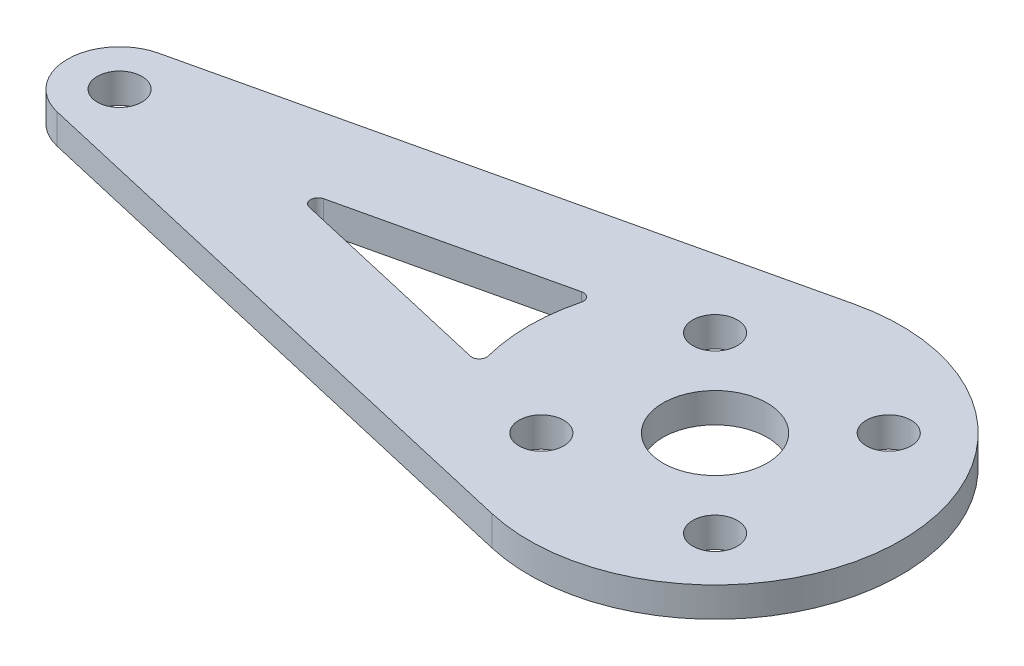
ISO-10303-21;
HEADER;
FILE_DESCRIPTION(('STEP AP214'),'2;1');
FILE_NAME('part.step','',(''),(''),'','','');
FILE_SCHEMA(('AUTOMOTIVE_DESIGN { 1 0 10303 214 1 1 1 1 }'));
ENDSEC;
DATA;
#1=APPLICATION_CONTEXT('core data for automotive mechanical design processes');
#2=APPLICATION_PROTOCOL_DEFINITION('international standard','automotive_design',2000,#1);
#3=PRODUCT_CONTEXT('',#1,'mechanical');
#4=PRODUCT('Part','Part','',(#3));
#5=PRODUCT_RELATED_PRODUCT_CATEGORY('part','',(#4));
#6=PRODUCT_DEFINITION_FORMATION('','',#4);
#7=PRODUCT_DEFINITION_CONTEXT('part definition',#1,'design');
#8=PRODUCT_DEFINITION('design','',#6,#7);
#9=PRODUCT_DEFINITION_SHAPE('','',#8);
#10=(LENGTH_UNIT() NAMED_UNIT(*) SI_UNIT(.MILLI.,.METRE.));
#11=(NAMED_UNIT(*) PLANE_ANGLE_UNIT() SI_UNIT($,.RADIAN.));
#12=(NAMED_UNIT(*) SI_UNIT($,.STERADIAN.) SOLID_ANGLE_UNIT());
#13=UNCERTAINTY_MEASURE_WITH_UNIT(LENGTH_MEASURE(1.E-05),#10,'distance_accuracy_value','');
#14=(GEOMETRIC_REPRESENTATION_CONTEXT(3) GLOBAL_UNCERTAINTY_ASSIGNED_CONTEXT((#13)) GLOBAL_UNIT_ASSIGNED_CONTEXT((#10,
#11,#12)) REPRESENTATION_CONTEXT('',''));
#15=CARTESIAN_POINT('',(0.,0.,0.));
#16=DIRECTION('',(0.,0.,1.));
#17=DIRECTION('',(1.,0.,0.));
#18=AXIS2_PLACEMENT_3D('',#15,#16,#17);
#19=CARTESIAN_POINT('',(0.,2.,0.));
#20=DIRECTION('',(0.,-1.,0.));
#21=DIRECTION('',(0.,0.,-1.));
#22=AXIS2_PLACEMENT_3D('',#19,#20,#21);
#23=CYLINDRICAL_SURFACE('',#22,12.5);
#24=CARTESIAN_POINT('',(0.,2.,0.));
#25=DIRECTION('',(0.,1.,0.));
#26=DIRECTION('',(0.,0.,1.));
#27=AXIS2_PLACEMENT_3D('',#24,#25,#26);
#28=CIRCLE('',#27,12.5);
#29=CARTESIAN_POINT('',(-12.1027436823799,2.,-3.12627499727942));
#30=VERTEX_POINT('',#29);
#31=CARTESIAN_POINT('',(-12.1027436823799,2.,3.12627499727942));
#32=VERTEX_POINT('',#31);
#33=EDGE_CURVE('E130',#30,#32,#28,.T.);
#34=ORIENTED_EDGE('',*,*,#33,.F.);
#35=DIRECTION('',(0.,-1.,0.));
#36=VECTOR('',#35,1.);
#37=CARTESIAN_POINT('',(-12.1027436823799,2.,-3.12627499727942));
#38=LINE('',#37,#36);
#39=CARTESIAN_POINT('',(-12.1027436823799,0.,-3.12627499727942));
#40=VERTEX_POINT('',#39);
#41=EDGE_CURVE('E159',#30,#40,#38,.T.);
#42=ORIENTED_EDGE('',*,*,#41,.T.);
#43=CARTESIAN_POINT('',(0.,0.,0.));
#44=DIRECTION('',(0.,1.,0.));
#45=DIRECTION('',(0.,0.,1.));
#46=AXIS2_PLACEMENT_3D('',#43,#44,#45);
#47=CIRCLE('',#46,12.5);
#48=CARTESIAN_POINT('',(-12.1027436823799,0.,3.12627499727942));
#49=VERTEX_POINT('',#48);
#50=EDGE_CURVE('E173',#40,#49,#47,.T.);
#51=ORIENTED_EDGE('',*,*,#50,.T.);
#52=DIRECTION('',(0.,-1.,0.));
#53=VECTOR('',#52,1.);
#54=CARTESIAN_POINT('',(-12.1027436823799,2.,3.12627499727942));
#55=LINE('',#54,#53);
#56=EDGE_CURVE('E53',#49,#32,#55,.F.);
#57=ORIENTED_EDGE('',*,*,#56,.T.);
#58=EDGE_LOOP('',(#34,#42,#51,#57));
#59=FACE_BOUND('',#58,.T.);
#60=ADVANCED_FACE('F38',(#59),#23,.T.);
#61=CARTESIAN_POINT('',(-1.46249999999999,2.,6.33333196271914));
#62=DIRECTION('',(0.224999999999998,0.,-0.974358763495254));
#63=DIRECTION('',(-0.974358763495254,0.,-0.224999999999998));
#64=AXIS2_PLACEMENT_3D('',#61,#62,#63);
#65=PLANE('',#64);
#66=DIRECTION('',(0.974358763495254,0.,0.224999999999998));
#67=VECTOR('',#66,1.);
#68=CARTESIAN_POINT('',(-1.46249999999999,0.,6.33333196271914));
#69=LINE('',#68,#67);
#70=CARTESIAN_POINT('',(-26.7791666666669,0.,0.487179381747607));
#71=VERTEX_POINT('',#70);
#72=CARTESIAN_POINT('',(-12.6993534296751,0.,3.73850537891823));
#73=VERTEX_POINT('',#72);
#74=EDGE_CURVE('E175',#71,#73,#69,.T.);
#75=ORIENTED_EDGE('',*,*,#74,.F.);
#76=DIRECTION('',(0.,-1.,0.));
#77=VECTOR('',#76,1.);
#78=CARTESIAN_POINT('',(-26.7791666666669,2.,0.487179381747608));
#79=LINE('',#78,#77);
#80=CARTESIAN_POINT('',(-26.7791666666669,2.,0.487179381747607));
#81=VERTEX_POINT('',#80);
#82=EDGE_CURVE('E156',#71,#81,#79,.F.);
#83=ORIENTED_EDGE('',*,*,#82,.T.);
#84=DIRECTION('',(0.974358763495254,0.,0.224999999999998));
#85=VECTOR('',#84,1.);
#86=CARTESIAN_POINT('',(-1.46249999999999,2.,6.33333196271914));
#87=LINE('',#86,#85);
#88=CARTESIAN_POINT('',(-12.6993534296751,2.,3.73850537891823));
#89=VERTEX_POINT('',#88);
#90=EDGE_CURVE('E186',#81,#89,#87,.T.);
#91=ORIENTED_EDGE('',*,*,#90,.T.);
#92=DIRECTION('',(0.,-1.,0.));
#93=VECTOR('',#92,1.);
#94=CARTESIAN_POINT('',(-12.6993534296751,2.,3.73850537891823));
#95=LINE('',#94,#93);
#96=EDGE_CURVE('E153',#89,#73,#95,.T.);
#97=ORIENTED_EDGE('',*,*,#96,.T.);
#98=EDGE_LOOP('',(#75,#83,#91,#97));
#99=FACE_BOUND('',#98,.T.);
#100=ADVANCED_FACE('F189',(#99),#65,.T.);
#101=CARTESIAN_POINT('',(-2.8125,2.,12.1794845436907));
#102=DIRECTION('',(0.225,0.,-0.974358763495254));
#103=DIRECTION('',(-0.974358763495254,0.,-0.225));
#104=AXIS2_PLACEMENT_3D('',#101,#102,#103);
#105=PLANE('',#104);
#106=DIRECTION('',(0.974358763495254,0.,0.225));
#107=VECTOR('',#106,1.);
#108=CARTESIAN_POINT('',(-2.8125,0.,12.1794845436907));
#109=LINE('',#108,#107);
#110=CARTESIAN_POINT('',(-40.7875,0.,3.41025567223339));
#111=VERTEX_POINT('',#110);
#112=CARTESIAN_POINT('',(-2.8125,0.,12.1794845436907));
#113=VERTEX_POINT('',#112);
#114=EDGE_CURVE('E142',#111,#113,#109,.T.);
#115=ORIENTED_EDGE('',*,*,#114,.T.);
#116=DIRECTION('',(0.,-1.,0.));
#117=VECTOR('',#116,1.);
#118=CARTESIAN_POINT('',(-2.8125,2.,12.1794845436907));
#119=LINE('',#118,#117);
#120=CARTESIAN_POINT('',(-2.8125,2.,12.1794845436907));
#121=VERTEX_POINT('',#120);
#122=EDGE_CURVE('E121',#121,#113,#119,.T.);
#123=ORIENTED_EDGE('',*,*,#122,.F.);
#124=DIRECTION('',(0.974358763495254,0.,0.225));
#125=VECTOR('',#124,1.);
#126=CARTESIAN_POINT('',(-2.8125,2.,12.1794845436907));
#127=LINE('',#126,#125);
#128=CARTESIAN_POINT('',(-40.7875,2.,3.41025567223339));
#129=VERTEX_POINT('',#128);
#130=EDGE_CURVE('E128',#129,#121,#127,.T.);
#131=ORIENTED_EDGE('',*,*,#130,.F.);
#132=DIRECTION('',(0.,-1.,0.));
#133=VECTOR('',#132,1.);
#134=CARTESIAN_POINT('',(-40.7875,2.,3.41025567223339));
#135=LINE('',#134,#133);
#136=EDGE_CURVE('E215',#129,#111,#135,.T.);
#137=ORIENTED_EDGE('',*,*,#136,.T.);
#138=EDGE_LOOP('',(#115,#123,#131,#137));
#139=FACE_BOUND('',#138,.T.);
#140=ADVANCED_FACE('F140',(#139),#105,.F.);
#141=CARTESIAN_POINT('',(-2.8125,0.,-12.1794845436907));
#142=VERTEX_POINT('',#141);
#143=EDGE_CURVE('E181',#113,#142,#47,.T.);
#144=ORIENTED_EDGE('',*,*,#143,.T.);
#145=DIRECTION('',(0.,-1.,0.));
#146=VECTOR('',#145,1.);
#147=CARTESIAN_POINT('',(-2.8125,2.,-12.1794845436907));
#148=LINE('',#147,#146);
#149=CARTESIAN_POINT('',(-2.8125,2.,-12.1794845436907));
#150=VERTEX_POINT('',#149);
#151=EDGE_CURVE('E123',#150,#142,#148,.T.);
#152=ORIENTED_EDGE('',*,*,#151,.F.);
#153=EDGE_CURVE('E116',#121,#150,#28,.T.);
#154=ORIENTED_EDGE('',*,*,#153,.F.);
#155=ORIENTED_EDGE('',*,*,#122,.T.);
#156=EDGE_LOOP('',(#144,#152,#154,#155));
#157=FACE_BOUND('',#156,.T.);
#158=ADVANCED_FACE('F119',(#157),#23,.T.);
#159=CARTESIAN_POINT('',(-2.8125,2.,-12.1794845436907));
#160=DIRECTION('',(-0.225,0.,-0.974358763495254));
#161=DIRECTION('',(-0.974358763495254,0.,0.225));
#162=AXIS2_PLACEMENT_3D('',#159,#160,#161);
#163=PLANE('',#162);
#164=DIRECTION('',(0.974358763495254,0.,-0.225));
#165=VECTOR('',#164,1.);
#166=CARTESIAN_POINT('',(-2.8125,0.,-12.1794845436907));
#167=LINE('',#166,#165);
#168=CARTESIAN_POINT('',(-40.7875,0.,-3.41025567223338));
#169=VERTEX_POINT('',#168);
#170=EDGE_CURVE('E217',#169,#142,#167,.T.);
#171=ORIENTED_EDGE('',*,*,#170,.F.);
#172=DIRECTION('',(0.,-1.,0.));
#173=VECTOR('',#172,1.);
#174=CARTESIAN_POINT('',(-40.7875,2.,-3.41025567223338));
#175=LINE('',#174,#173);
#176=CARTESIAN_POINT('',(-40.7875,2.,-3.41025567223338));
#177=VERTEX_POINT('',#176);
#178=EDGE_CURVE('E147',#177,#169,#175,.T.);
#179=ORIENTED_EDGE('',*,*,#178,.F.);
#180=DIRECTION('',(0.974358763495254,0.,-0.225));
#181=VECTOR('',#180,1.);
#182=CARTESIAN_POINT('',(-2.8125,2.,-12.1794845436907));
#183=LINE('',#182,#181);
#184=EDGE_CURVE('E127',#177,#150,#183,.T.);
#185=ORIENTED_EDGE('',*,*,#184,.T.);
#186=ORIENTED_EDGE('',*,*,#151,.T.);
#187=EDGE_LOOP('',(#171,#179,#185,#186));
#188=FACE_BOUND('',#187,.T.);
#189=ADVANCED_FACE('F248',(#188),#163,.T.);
#190=CARTESIAN_POINT('',(0.,2.,0.));
#191=DIRECTION('',(0.,-1.,0.));
#192=DIRECTION('',(0.,0.,-1.));
#193=AXIS2_PLACEMENT_3D('',#190,#191,#192);
#194=CYLINDRICAL_SURFACE('',#193,3.5);
#195=CARTESIAN_POINT('',(0.,2.,0.));
#196=DIRECTION('',(0.,1.,0.));
#197=DIRECTION('',(0.,0.,1.));
#198=AXIS2_PLACEMENT_3D('',#195,#196,#197);
#199=CIRCLE('',#198,3.5);
#200=CARTESIAN_POINT('',(0.,2.,3.5));
#201=VERTEX_POINT('',#200);
#202=EDGE_CURVE('E209',#201,#201,#199,.T.);
#203=ORIENTED_EDGE('',*,*,#202,.T.);
#204=EDGE_LOOP('',(#203));
#205=FACE_BOUND('',#204,.T.);
#206=CARTESIAN_POINT('',(0.,0.,0.));
#207=DIRECTION('',(0.,1.,0.));
#208=DIRECTION('',(0.,0.,1.));
#209=AXIS2_PLACEMENT_3D('',#206,#207,#208);
#210=CIRCLE('',#209,3.5);
#211=CARTESIAN_POINT('',(0.,0.,3.5));
#212=VERTEX_POINT('',#211);
#213=EDGE_CURVE('E237',#212,#212,#210,.T.);
#214=ORIENTED_EDGE('',*,*,#213,.F.);
#215=EDGE_LOOP('',(#214));
#216=FACE_BOUND('',#215,.T.);
#217=ADVANCED_FACE('F250',(#205,#216),#194,.F.);
#218=CARTESIAN_POINT('',(5.83363094478901,2.,-5.83363094478903));
#219=DIRECTION('',(0.,-1.,0.));
#220=DIRECTION('',(0.,0.,-1.));
#221=AXIS2_PLACEMENT_3D('',#218,#219,#220);
#222=CYLINDRICAL_SURFACE('',#221,1.5);
#223=CARTESIAN_POINT('',(5.83363094478901,2.,-5.83363094478903));
#224=DIRECTION('',(0.,1.,0.));
#225=DIRECTION('',(0.,0.,1.));
#226=AXIS2_PLACEMENT_3D('',#223,#224,#225);
#227=CIRCLE('',#226,1.5);
#228=CARTESIAN_POINT('',(5.83363094478901,2.,-4.33363094478903));
#229=VERTEX_POINT('',#228);
#230=EDGE_CURVE('E206',#229,#229,#227,.T.);
#231=ORIENTED_EDGE('',*,*,#230,.T.);
#232=EDGE_LOOP('',(#231));
#233=FACE_BOUND('',#232,.T.);
#234=CARTESIAN_POINT('',(5.83363094478901,0.,-5.83363094478903));
#235=DIRECTION('',(0.,1.,0.));
#236=DIRECTION('',(0.,0.,1.));
#237=AXIS2_PLACEMENT_3D('',#234,#235,#236);
#238=CIRCLE('',#237,1.5);
#239=CARTESIAN_POINT('',(5.83363094478901,0.,-4.33363094478903));
#240=VERTEX_POINT('',#239);
#241=EDGE_CURVE('E234',#240,#240,#238,.T.);
#242=ORIENTED_EDGE('',*,*,#241,.F.);
#243=EDGE_LOOP('',(#242));
#244=FACE_BOUND('',#243,.T.);
#245=ADVANCED_FACE('F256',(#233,#244),#222,.F.);
#246=CARTESIAN_POINT('',(5.83363094478934,2.,5.83363094478901));
#247=DIRECTION('',(0.,-1.,0.));
#248=DIRECTION('',(0.,0.,-1.));
#249=AXIS2_PLACEMENT_3D('',#246,#247,#248);
#250=CYLINDRICAL_SURFACE('',#249,1.5);
#251=CARTESIAN_POINT('',(5.83363094478934,2.,5.83363094478901));
#252=DIRECTION('',(0.,1.,0.));
#253=DIRECTION('',(0.,0.,1.));
#254=AXIS2_PLACEMENT_3D('',#251,#252,#253);
#255=CIRCLE('',#254,1.5);
#256=CARTESIAN_POINT('',(5.83363094478934,2.,7.33363094478901));
#257=VERTEX_POINT('',#256);
#258=EDGE_CURVE('E203',#257,#257,#255,.T.);
#259=ORIENTED_EDGE('',*,*,#258,.T.);
#260=EDGE_LOOP('',(#259));
#261=FACE_BOUND('',#260,.T.);
#262=CARTESIAN_POINT('',(5.83363094478934,0.,5.83363094478901));
#263=DIRECTION('',(0.,1.,0.));
#264=DIRECTION('',(0.,0.,1.));
#265=AXIS2_PLACEMENT_3D('',#262,#263,#264);
#266=CIRCLE('',#265,1.5);
#267=CARTESIAN_POINT('',(5.83363094478934,0.,7.33363094478901));
#268=VERTEX_POINT('',#267);
#269=EDGE_CURVE('E231',#268,#268,#266,.T.);
#270=ORIENTED_EDGE('',*,*,#269,.F.);
#271=EDGE_LOOP('',(#270));
#272=FACE_BOUND('',#271,.T.);
#273=ADVANCED_FACE('F289',(#261,#272),#250,.F.);
#274=CARTESIAN_POINT('',(-5.83363094478869,2.,5.83363094478934));
#275=DIRECTION('',(0.,-1.,0.));
#276=DIRECTION('',(0.,0.,-1.));
#277=AXIS2_PLACEMENT_3D('',#274,#275,#276);
#278=CYLINDRICAL_SURFACE('',#277,1.5);
#279=CARTESIAN_POINT('',(-5.83363094478869,2.,5.83363094478934));
#280=DIRECTION('',(0.,1.,0.));
#281=DIRECTION('',(0.,0.,1.));
#282=AXIS2_PLACEMENT_3D('',#279,#280,#281);
#283=CIRCLE('',#282,1.5);
#284=CARTESIAN_POINT('',(-5.83363094478869,2.,7.33363094478934));
#285=VERTEX_POINT('',#284);
#286=EDGE_CURVE('E200',#285,#285,#283,.T.);
#287=ORIENTED_EDGE('',*,*,#286,.T.);
#288=EDGE_LOOP('',(#287));
#289=FACE_BOUND('',#288,.T.);
#290=CARTESIAN_POINT('',(-5.83363094478869,0.,5.83363094478934));
#291=DIRECTION('',(0.,1.,0.));
#292=DIRECTION('',(0.,0.,1.));
#293=AXIS2_PLACEMENT_3D('',#290,#291,#292);
#294=CIRCLE('',#293,1.5);
#295=CARTESIAN_POINT('',(-5.83363094478869,0.,7.33363094478934));
#296=VERTEX_POINT('',#295);
#297=EDGE_CURVE('E228',#296,#296,#294,.T.);
#298=ORIENTED_EDGE('',*,*,#297,.F.);
#299=EDGE_LOOP('',(#298));
#300=FACE_BOUND('',#299,.T.);
#301=ADVANCED_FACE('F282',(#289,#300),#278,.F.);
#302=CARTESIAN_POINT('',(-5.83363094478903,2.,-5.83363094478869));
#303=DIRECTION('',(0.,-1.,0.));
#304=DIRECTION('',(0.,0.,-1.));
#305=AXIS2_PLACEMENT_3D('',#302,#303,#304);
#306=CYLINDRICAL_SURFACE('',#305,1.5);
#307=CARTESIAN_POINT('',(-5.83363094478903,2.,-5.83363094478869));
#308=DIRECTION('',(0.,1.,0.));
#309=DIRECTION('',(0.,0.,1.));
#310=AXIS2_PLACEMENT_3D('',#307,#308,#309);
#311=CIRCLE('',#310,1.5);
#312=CARTESIAN_POINT('',(-5.83363094478903,2.,-4.33363094478869));
#313=VERTEX_POINT('',#312);
#314=EDGE_CURVE('E193',#313,#313,#311,.T.);
#315=ORIENTED_EDGE('',*,*,#314,.T.);
#316=EDGE_LOOP('',(#315));
#317=FACE_BOUND('',#316,.T.);
#318=CARTESIAN_POINT('',(-5.83363094478903,0.,-5.83363094478869));
#319=DIRECTION('',(0.,1.,0.));
#320=DIRECTION('',(0.,0.,1.));
#321=AXIS2_PLACEMENT_3D('',#318,#319,#320);
#322=CIRCLE('',#321,1.5);
#323=CARTESIAN_POINT('',(-5.83363094478903,0.,-4.33363094478869));
#324=VERTEX_POINT('',#323);
#325=EDGE_CURVE('E225',#324,#324,#322,.T.);
#326=ORIENTED_EDGE('',*,*,#325,.F.);
#327=EDGE_LOOP('',(#326));
#328=FACE_BOUND('',#327,.T.);
#329=ADVANCED_FACE('F277',(#317,#328),#306,.F.);
#330=CARTESIAN_POINT('',(-1.46249999999996,2.,-6.33333196271911));
#331=DIRECTION('',(-0.224999999999996,0.,-0.974358763495255));
#332=DIRECTION('',(-0.974358763495255,0.,0.224999999999996));
#333=AXIS2_PLACEMENT_3D('',#330,#331,#332);
#334=PLANE('',#333);
#335=DIRECTION('',(0.974358763495255,0.,-0.224999999999996));
#336=VECTOR('',#335,1.);
#337=CARTESIAN_POINT('',(-1.46249999999996,2.,-6.33333196271911));
#338=LINE('',#337,#336);
#339=CARTESIAN_POINT('',(-26.7791666666669,2.,-0.487179381747645));
#340=VERTEX_POINT('',#339);
#341=CARTESIAN_POINT('',(-12.6993534296751,2.,-3.73850537891822));
#342=VERTEX_POINT('',#341);
#343=EDGE_CURVE('E191',#340,#342,#338,.T.);
#344=ORIENTED_EDGE('',*,*,#343,.F.);
#345=DIRECTION('',(0.,-1.,0.));
#346=VECTOR('',#345,1.);
#347=CARTESIAN_POINT('',(-26.7791666666669,2.,-0.487179381747646));
#348=LINE('',#347,#346);
#349=CARTESIAN_POINT('',(-26.7791666666669,0.,-0.487179381747645));
#350=VERTEX_POINT('',#349);
#351=EDGE_CURVE('E145',#340,#350,#348,.T.);
#352=ORIENTED_EDGE('',*,*,#351,.T.);
#353=DIRECTION('',(0.974358763495255,0.,-0.224999999999996));
#354=VECTOR('',#353,1.);
#355=CARTESIAN_POINT('',(-1.46249999999996,0.,-6.33333196271911));
#356=LINE('',#355,#354);
#357=CARTESIAN_POINT('',(-12.6993534296751,0.,-3.73850537891822));
#358=VERTEX_POINT('',#357);
#359=EDGE_CURVE('E222',#350,#358,#356,.T.);
#360=ORIENTED_EDGE('',*,*,#359,.T.);
#361=DIRECTION('',(0.,1.,0.));
#362=VECTOR('',#361,1.);
#363=CARTESIAN_POINT('',(-12.699353429675,2.,-3.73850537891823));
#364=LINE('',#363,#362);
#365=EDGE_CURVE('E143',#358,#342,#364,.T.);
#366=ORIENTED_EDGE('',*,*,#365,.T.);
#367=EDGE_LOOP('',(#344,#352,#360,#366));
#368=FACE_BOUND('',#367,.T.);
#369=ADVANCED_FACE('F270',(#368),#334,.F.);
#370=CARTESIAN_POINT('',(-40.,2.,0.));
#371=DIRECTION('',(0.,-1.,0.));
#372=DIRECTION('',(0.,0.,-1.));
#373=AXIS2_PLACEMENT_3D('',#370,#371,#372);
#374=CYLINDRICAL_SURFACE('',#373,3.5);
#375=CARTESIAN_POINT('',(-40.,0.,0.));
#376=DIRECTION('',(0.,1.,0.));
#377=DIRECTION('',(0.,0.,1.));
#378=AXIS2_PLACEMENT_3D('',#375,#376,#377);
#379=CIRCLE('',#378,3.5);
#380=EDGE_CURVE('E179',#169,#111,#379,.T.);
#381=ORIENTED_EDGE('',*,*,#380,.T.);
#382=ORIENTED_EDGE('',*,*,#136,.F.);
#383=CARTESIAN_POINT('',(-40.,2.,0.));
#384=DIRECTION('',(0.,1.,0.));
#385=DIRECTION('',(0.,0.,1.));
#386=AXIS2_PLACEMENT_3D('',#383,#384,#385);
#387=CIRCLE('',#386,3.5);
#388=EDGE_CURVE('E134',#177,#129,#387,.T.);
#389=ORIENTED_EDGE('',*,*,#388,.F.);
#390=ORIENTED_EDGE('',*,*,#178,.T.);
#391=EDGE_LOOP('',(#381,#382,#389,#390));
#392=FACE_BOUND('',#391,.T.);
#393=ADVANCED_FACE('F244',(#392),#374,.T.);
#394=CARTESIAN_POINT('',(-40.,2.,0.));
#395=DIRECTION('',(0.,-1.,0.));
#396=DIRECTION('',(0.,0.,-1.));
#397=AXIS2_PLACEMENT_3D('',#394,#395,#396);
#398=CYLINDRICAL_SURFACE('',#397,1.5);
#399=CARTESIAN_POINT('',(-40.,2.,0.));
#400=DIRECTION('',(0.,1.,0.));
#401=DIRECTION('',(0.,0.,1.));
#402=AXIS2_PLACEMENT_3D('',#399,#400,#401);
#403=CIRCLE('',#402,1.5);
#404=CARTESIAN_POINT('',(-40.,2.,1.50000000000001));
#405=VERTEX_POINT('',#404);
#406=EDGE_CURVE('E212',#405,#405,#403,.T.);
#407=ORIENTED_EDGE('',*,*,#406,.T.);
#408=EDGE_LOOP('',(#407));
#409=FACE_BOUND('',#408,.T.);
#410=CARTESIAN_POINT('',(-40.,0.,0.));
#411=DIRECTION('',(0.,1.,0.));
#412=DIRECTION('',(0.,0.,1.));
#413=AXIS2_PLACEMENT_3D('',#410,#411,#412);
#414=CIRCLE('',#413,1.5);
#415=CARTESIAN_POINT('',(-40.,0.,1.50000000000001));
#416=VERTEX_POINT('',#415);
#417=EDGE_CURVE('E138',#416,#416,#414,.T.);
#418=ORIENTED_EDGE('',*,*,#417,.F.);
#419=EDGE_LOOP('',(#418));
#420=FACE_BOUND('',#419,.T.);
#421=ADVANCED_FACE('F269',(#409,#420),#398,.F.);
#422=CARTESIAN_POINT('',(0.,2.,0.));
#423=DIRECTION('',(0.,1.,0.));
#424=DIRECTION('',(0.,0.,1.));
#425=AXIS2_PLACEMENT_3D('',#422,#423,#424);
#426=PLANE('',#425);
#427=ORIENTED_EDGE('',*,*,#130,.T.);
#428=ORIENTED_EDGE('',*,*,#153,.T.);
#429=ORIENTED_EDGE('',*,*,#184,.F.);
#430=ORIENTED_EDGE('',*,*,#388,.T.);
#431=EDGE_LOOP('',(#427,#428,#429,#430));
#432=FACE_BOUND('',#431,.T.);
#433=ORIENTED_EDGE('',*,*,#343,.T.);
#434=CARTESIAN_POINT('',(-12.5868534296751,2.,-3.2513259971706));
#435=DIRECTION('',(0.,1.,0.));
#436=DIRECTION('',(0.,0.,1.));
#437=AXIS2_PLACEMENT_3D('',#434,#435,#436);
#438=CIRCLE('',#437,0.5);
#439=EDGE_CURVE('E60',#342,#30,#438,.F.);
#440=ORIENTED_EDGE('',*,*,#439,.T.);
#441=ORIENTED_EDGE('',*,*,#33,.T.);
#442=CARTESIAN_POINT('',(-12.5868534296751,2.,3.2513259971706));
#443=DIRECTION('',(0.,1.,0.));
#444=DIRECTION('',(0.,0.,1.));
#445=AXIS2_PLACEMENT_3D('',#442,#443,#444);
#446=CIRCLE('',#445,0.5);
#447=EDGE_CURVE('E11',#32,#89,#446,.F.);
#448=ORIENTED_EDGE('',*,*,#447,.T.);
#449=ORIENTED_EDGE('',*,*,#90,.F.);
#450=CARTESIAN_POINT('',(-26.6666666666669,2.,0.));
#451=DIRECTION('',(0.,1.,0.));
#452=DIRECTION('',(0.,0.,1.));
#453=AXIS2_PLACEMENT_3D('',#450,#451,#452);
#454=CIRCLE('',#453,0.5);
#455=EDGE_CURVE('E164',#81,#340,#454,.F.);
#456=ORIENTED_EDGE('',*,*,#455,.T.);
#457=EDGE_LOOP('',(#433,#440,#441,#448,#449,#456));
#458=FACE_BOUND('',#457,.T.);
#459=ORIENTED_EDGE('',*,*,#314,.F.);
#460=EDGE_LOOP('',(#459));
#461=FACE_BOUND('',#460,.T.);
#462=ORIENTED_EDGE('',*,*,#286,.F.);
#463=EDGE_LOOP('',(#462));
#464=FACE_BOUND('',#463,.T.);
#465=ORIENTED_EDGE('',*,*,#258,.F.);
#466=EDGE_LOOP('',(#465));
#467=FACE_BOUND('',#466,.T.);
#468=ORIENTED_EDGE('',*,*,#230,.F.);
#469=EDGE_LOOP('',(#468));
#470=FACE_BOUND('',#469,.T.);
#471=ORIENTED_EDGE('',*,*,#202,.F.);
#472=EDGE_LOOP('',(#471));
#473=FACE_BOUND('',#472,.T.);
#474=ORIENTED_EDGE('',*,*,#406,.F.);
#475=EDGE_LOOP('',(#474));
#476=FACE_BOUND('',#475,.T.);
#477=ADVANCED_FACE('F132',(#432,#458,#461,#464,#467,#470,#473,#476),#426,.T.);
#478=CARTESIAN_POINT('',(0.,0.,0.));
#479=DIRECTION('',(0.,1.,0.));
#480=DIRECTION('',(0.,0.,1.));
#481=AXIS2_PLACEMENT_3D('',#478,#479,#480);
#482=PLANE('',#481);
#483=ORIENTED_EDGE('',*,*,#114,.F.);
#484=ORIENTED_EDGE('',*,*,#380,.F.);
#485=ORIENTED_EDGE('',*,*,#170,.T.);
#486=ORIENTED_EDGE('',*,*,#143,.F.);
#487=EDGE_LOOP('',(#483,#484,#485,#486));
#488=FACE_BOUND('',#487,.T.);
#489=ORIENTED_EDGE('',*,*,#50,.F.);
#490=CARTESIAN_POINT('',(-12.5868534296751,0.,-3.2513259971706));
#491=DIRECTION('',(0.,1.,0.));
#492=DIRECTION('',(0.,0.,1.));
#493=AXIS2_PLACEMENT_3D('',#490,#491,#492);
#494=CIRCLE('',#493,0.5);
#495=EDGE_CURVE('E166',#40,#358,#494,.T.);
#496=ORIENTED_EDGE('',*,*,#495,.T.);
#497=ORIENTED_EDGE('',*,*,#359,.F.);
#498=CARTESIAN_POINT('',(-26.6666666666669,0.,0.));
#499=DIRECTION('',(0.,1.,0.));
#500=DIRECTION('',(0.,0.,1.));
#501=AXIS2_PLACEMENT_3D('',#498,#499,#500);
#502=CIRCLE('',#501,0.5);
#503=EDGE_CURVE('E162',#350,#71,#502,.T.);
#504=ORIENTED_EDGE('',*,*,#503,.T.);
#505=ORIENTED_EDGE('',*,*,#74,.T.);
#506=CARTESIAN_POINT('',(-12.5868534296751,0.,3.2513259971706));
#507=DIRECTION('',(0.,1.,0.));
#508=DIRECTION('',(0.,0.,1.));
#509=AXIS2_PLACEMENT_3D('',#506,#507,#508);
#510=CIRCLE('',#509,0.5);
#511=EDGE_CURVE('E46',#73,#49,#510,.T.);
#512=ORIENTED_EDGE('',*,*,#511,.T.);
#513=EDGE_LOOP('',(#489,#496,#497,#504,#505,#512));
#514=FACE_BOUND('',#513,.T.);
#515=ORIENTED_EDGE('',*,*,#325,.T.);
#516=EDGE_LOOP('',(#515));
#517=FACE_BOUND('',#516,.T.);
#518=ORIENTED_EDGE('',*,*,#297,.T.);
#519=EDGE_LOOP('',(#518));
#520=FACE_BOUND('',#519,.T.);
#521=ORIENTED_EDGE('',*,*,#269,.T.);
#522=EDGE_LOOP('',(#521));
#523=FACE_BOUND('',#522,.T.);
#524=ORIENTED_EDGE('',*,*,#241,.T.);
#525=EDGE_LOOP('',(#524));
#526=FACE_BOUND('',#525,.T.);
#527=ORIENTED_EDGE('',*,*,#213,.T.);
#528=EDGE_LOOP('',(#527));
#529=FACE_BOUND('',#528,.T.);
#530=ORIENTED_EDGE('',*,*,#417,.T.);
#531=EDGE_LOOP('',(#530));
#532=FACE_BOUND('',#531,.T.);
#533=ADVANCED_FACE('F171',(#488,#514,#517,#520,#523,#526,#529,#532),#482,.F.);
#534=CARTESIAN_POINT('',(-26.6666666666669,2.,0.));
#535=DIRECTION('',(0.,-1.,0.));
#536=DIRECTION('',(0.,0.,-1.));
#537=AXIS2_PLACEMENT_3D('',#534,#535,#536);
#538=CYLINDRICAL_SURFACE('',#537,0.5);
#539=ORIENTED_EDGE('',*,*,#455,.F.);
#540=ORIENTED_EDGE('',*,*,#82,.F.);
#541=ORIENTED_EDGE('',*,*,#503,.F.);
#542=ORIENTED_EDGE('',*,*,#351,.F.);
#543=EDGE_LOOP('',(#539,#540,#541,#542));
#544=FACE_BOUND('',#543,.T.);
#545=ADVANCED_FACE('F299',(#544),#538,.F.);
#546=CARTESIAN_POINT('',(-12.5868534296751,2.,-3.2513259971706));
#547=DIRECTION('',(0.,-1.,0.));
#548=DIRECTION('',(0.,0.,-1.));
#549=AXIS2_PLACEMENT_3D('',#546,#547,#548);
#550=CYLINDRICAL_SURFACE('',#549,0.5);
#551=ORIENTED_EDGE('',*,*,#439,.F.);
#552=ORIENTED_EDGE('',*,*,#365,.F.);
#553=ORIENTED_EDGE('',*,*,#495,.F.);
#554=ORIENTED_EDGE('',*,*,#41,.F.);
#555=EDGE_LOOP('',(#551,#552,#553,#554));
#556=FACE_BOUND('',#555,.T.);
#557=ADVANCED_FACE('F315',(#556),#550,.F.);
#558=CARTESIAN_POINT('',(-12.5868534296751,2.,3.2513259971706));
#559=DIRECTION('',(0.,-1.,0.));
#560=DIRECTION('',(0.,0.,-1.));
#561=AXIS2_PLACEMENT_3D('',#558,#559,#560);
#562=CYLINDRICAL_SURFACE('',#561,0.5);
#563=ORIENTED_EDGE('',*,*,#447,.F.);
#564=ORIENTED_EDGE('',*,*,#56,.F.);
#565=ORIENTED_EDGE('',*,*,#511,.F.);
#566=ORIENTED_EDGE('',*,*,#96,.F.);
#567=EDGE_LOOP('',(#563,#564,#565,#566));
#568=FACE_BOUND('',#567,.T.);
#569=ADVANCED_FACE('F40',(#568),#562,.F.);
#570=CLOSED_SHELL('',(#60,#100,#140,#158,#189,#217,#245,#273,#301,#329,#369,#393,#421,#477,#533,
#545,#557,#569));
#571=MANIFOLD_SOLID_BREP('B2',#570);
#572=ADVANCED_BREP_SHAPE_REPRESENTATION('',(#18,#571),#14);
#573=SHAPE_DEFINITION_REPRESENTATION(#9,#572);
ENDSEC;
END-ISO-10303-21;
